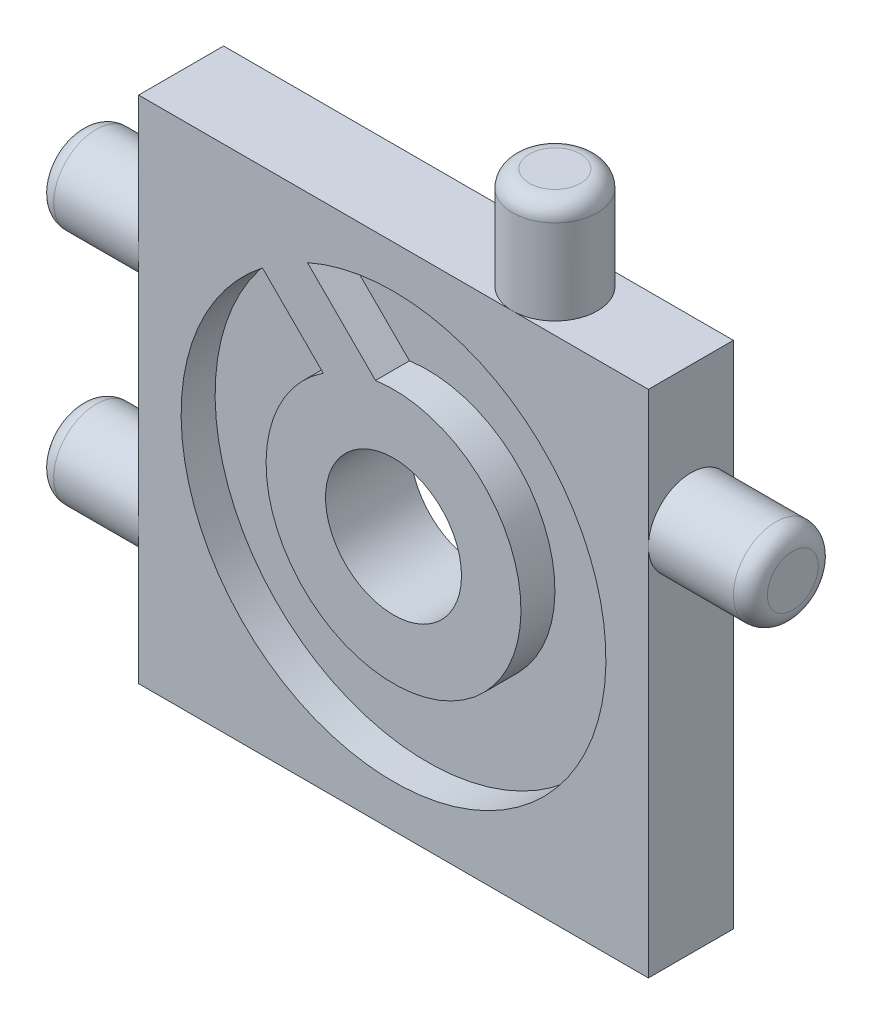
ISO-10303-21;
HEADER;
FILE_DESCRIPTION(('STEP AP214'),'2;1');
FILE_NAME('part.step','',(''),(''),'','','');
FILE_SCHEMA(('AUTOMOTIVE_DESIGN { 1 0 10303 214 1 1 1 1 }'));
ENDSEC;
DATA;
#1=APPLICATION_CONTEXT('core data for automotive mechanical design processes');
#2=APPLICATION_PROTOCOL_DEFINITION('international standard','automotive_design',2000,#1);
#3=PRODUCT_CONTEXT('',#1,'mechanical');
#4=PRODUCT('Part','Part','',(#3));
#5=PRODUCT_RELATED_PRODUCT_CATEGORY('part','',(#4));
#6=PRODUCT_DEFINITION_FORMATION('','',#4);
#7=PRODUCT_DEFINITION_CONTEXT('part definition',#1,'design');
#8=PRODUCT_DEFINITION('design','',#6,#7);
#9=PRODUCT_DEFINITION_SHAPE('','',#8);
#10=(LENGTH_UNIT() NAMED_UNIT(*) SI_UNIT(.MILLI.,.METRE.));
#11=(NAMED_UNIT(*) PLANE_ANGLE_UNIT() SI_UNIT($,.RADIAN.));
#12=(NAMED_UNIT(*) SI_UNIT($,.STERADIAN.) SOLID_ANGLE_UNIT());
#13=UNCERTAINTY_MEASURE_WITH_UNIT(LENGTH_MEASURE(1.E-05),#10,'distance_accuracy_value','');
#14=(GEOMETRIC_REPRESENTATION_CONTEXT(3) GLOBAL_UNCERTAINTY_ASSIGNED_CONTEXT((#13)) GLOBAL_UNIT_ASSIGNED_CONTEXT((#10,
#11,#12)) REPRESENTATION_CONTEXT('',''));
#15=CARTESIAN_POINT('',(0.,0.,0.));
#16=DIRECTION('',(0.,0.,1.));
#17=DIRECTION('',(1.,0.,0.));
#18=AXIS2_PLACEMENT_3D('',#15,#16,#17);
#19=CARTESIAN_POINT('',(0.,0.,0.));
#20=DIRECTION('',(0.,0.,1.));
#21=DIRECTION('',(1.,0.,0.));
#22=AXIS2_PLACEMENT_3D('',#19,#20,#21);
#23=PLANE('',#22);
#24=DIRECTION('',(0.,-1.,0.));
#25=VECTOR('',#24,1.);
#26=CARTESIAN_POINT('',(-15.,15.,0.));
#27=LINE('',#26,#25);
#28=CARTESIAN_POINT('',(-15.,15.,0.));
#29=VERTEX_POINT('',#28);
#30=CARTESIAN_POINT('',(-15.,7.,0.));
#31=VERTEX_POINT('',#30);
#32=EDGE_CURVE('E205',#29,#31,#27,.T.);
#33=ORIENTED_EDGE('',*,*,#32,.F.);
#34=DIRECTION('',(1.,0.,0.));
#35=VECTOR('',#34,1.);
#36=CARTESIAN_POINT('',(-15.,15.,0.));
#37=LINE('',#36,#35);
#38=CARTESIAN_POINT('',(7.,15.,0.));
#39=VERTEX_POINT('',#38);
#40=EDGE_CURVE('E217',#29,#39,#37,.T.);
#41=ORIENTED_EDGE('',*,*,#40,.T.);
#42=CARTESIAN_POINT('',(15.,15.,0.));
#43=VERTEX_POINT('',#42);
#44=EDGE_CURVE('E216',#39,#43,#37,.T.);
#45=ORIENTED_EDGE('',*,*,#44,.T.);
#46=DIRECTION('',(0.,-1.,0.));
#47=VECTOR('',#46,1.);
#48=CARTESIAN_POINT('',(15.,15.,0.));
#49=LINE('',#48,#47);
#50=CARTESIAN_POINT('',(15.,6.99999999999999,0.));
#51=VERTEX_POINT('',#50);
#52=EDGE_CURVE('E213',#43,#51,#49,.T.);
#53=ORIENTED_EDGE('',*,*,#52,.T.);
#54=CARTESIAN_POINT('',(15.,-15.,0.));
#55=VERTEX_POINT('',#54);
#56=EDGE_CURVE('E212',#51,#55,#49,.T.);
#57=ORIENTED_EDGE('',*,*,#56,.T.);
#58=DIRECTION('',(1.,0.,0.));
#59=VECTOR('',#58,1.);
#60=CARTESIAN_POINT('',(-15.,-15.,0.));
#61=LINE('',#60,#59);
#62=CARTESIAN_POINT('',(-15.,-15.,0.));
#63=VERTEX_POINT('',#62);
#64=EDGE_CURVE('E208',#63,#55,#61,.T.);
#65=ORIENTED_EDGE('',*,*,#64,.F.);
#66=CARTESIAN_POINT('',(-15.,-7.,0.));
#67=VERTEX_POINT('',#66);
#68=EDGE_CURVE('E189',#67,#63,#27,.T.);
#69=ORIENTED_EDGE('',*,*,#68,.F.);
#70=EDGE_CURVE('E209',#31,#67,#27,.T.);
#71=ORIENTED_EDGE('',*,*,#70,.F.);
#72=EDGE_LOOP('',(#33,#41,#45,#53,#57,#65,#69,#71));
#73=FACE_BOUND('',#72,.T.);
#74=CARTESIAN_POINT('',(0.,0.,0.));
#75=DIRECTION('',(0.,0.,1.));
#76=DIRECTION('',(1.,0.,0.));
#77=AXIS2_PLACEMENT_3D('',#74,#75,#76);
#78=CIRCLE('',#77,4.);
#79=CARTESIAN_POINT('',(4.,0.,0.));
#80=VERTEX_POINT('',#79);
#81=EDGE_CURVE('E170',#80,#80,#78,.T.);
#82=ORIENTED_EDGE('',*,*,#81,.T.);
#83=EDGE_LOOP('',(#82));
#84=FACE_BOUND('',#83,.T.);
#85=DIRECTION('',(0.707106781186547,0.707106781186548,0.));
#86=VECTOR('',#85,1.);
#87=CARTESIAN_POINT('',(-9.19238815542512,9.19238815542511,0.));
#88=LINE('',#87,#86);
#89=CARTESIAN_POINT('',(-8.13172798364529,10.2530483272049,0.));
#90=VERTEX_POINT('',#89);
#91=CARTESIAN_POINT('',(-6.01040764008565,12.3743686707646,0.));
#92=VERTEX_POINT('',#91);
#93=EDGE_CURVE('E11',#90,#92,#88,.T.);
#94=ORIENTED_EDGE('',*,*,#93,.F.);
#95=DIRECTION('',(0.707106781186548,-0.707106781186547,0.));
#96=VECTOR('',#95,1.);
#97=CARTESIAN_POINT('',(1.06066017177982,1.06066017177982,0.));
#98=LINE('',#97,#96);
#99=CARTESIAN_POINT('',(-3.18198051533946,5.3033008588991,0.));
#100=VERTEX_POINT('',#99);
#101=EDGE_CURVE('E418',#90,#100,#98,.T.);
#102=ORIENTED_EDGE('',*,*,#101,.T.);
#103=DIRECTION('',(0.707106781186547,0.707106781186548,0.));
#104=VECTOR('',#103,1.);
#105=CARTESIAN_POINT('',(-4.24264068711928,4.24264068711928,0.));
#106=LINE('',#105,#104);
#107=CARTESIAN_POINT('',(-1.06066017177982,7.42462120245875,0.));
#108=VERTEX_POINT('',#107);
#109=EDGE_CURVE('E413',#100,#108,#106,.T.);
#110=ORIENTED_EDGE('',*,*,#109,.T.);
#111=DIRECTION('',(0.707106781186547,-0.707106781186548,0.));
#112=VECTOR('',#111,1.);
#113=CARTESIAN_POINT('',(3.18198051533946,3.18198051533946,0.));
#114=LINE('',#113,#112);
#115=EDGE_CURVE('E372',#92,#108,#114,.T.);
#116=ORIENTED_EDGE('',*,*,#115,.F.);
#117=EDGE_LOOP('',(#94,#102,#110,#116));
#118=FACE_BOUND('',#117,.T.);
#119=ADVANCED_FACE('F33',(#73,#84,#118),#23,.F.);
#120=CARTESIAN_POINT('',(0.,0.,3.));
#121=DIRECTION('',(0.,0.,1.));
#122=DIRECTION('',(1.,0.,0.));
#123=AXIS2_PLACEMENT_3D('',#120,#121,#122);
#124=CYLINDRICAL_SURFACE('',#123,12.5);
#125=DIRECTION('',(0.,0.,1.));
#126=VECTOR('',#125,1.);
#127=CARTESIAN_POINT('',(-5.06423073589586,11.4281917665748,3.));
#128=LINE('',#127,#126);
#129=CARTESIAN_POINT('',(-5.06423073589586,11.4281917665748,3.));
#130=VERTEX_POINT('',#129);
#131=CARTESIAN_POINT('',(-5.06423073589586,11.4281917665748,5.));
#132=VERTEX_POINT('',#131);
#133=EDGE_CURVE('E151',#130,#132,#128,.T.);
#134=ORIENTED_EDGE('',*,*,#133,.F.);
#135=CARTESIAN_POINT('',(0.,0.,3.));
#136=DIRECTION('',(0.,0.,1.));
#137=DIRECTION('',(1.,0.,0.));
#138=AXIS2_PLACEMENT_3D('',#135,#136,#137);
#139=CIRCLE('',#138,12.5);
#140=CARTESIAN_POINT('',(-7.7143042156123,9.83562455917194,3.));
#141=VERTEX_POINT('',#140);
#142=EDGE_CURVE('E168',#141,#130,#139,.T.);
#143=ORIENTED_EDGE('',*,*,#142,.F.);
#144=DIRECTION('',(0.,0.,1.));
#145=VECTOR('',#144,1.);
#146=CARTESIAN_POINT('',(-7.7143042156123,9.83562455917194,3.));
#147=LINE('',#146,#145);
#148=CARTESIAN_POINT('',(-7.7143042156123,9.83562455917195,5.));
#149=VERTEX_POINT('',#148);
#150=EDGE_CURVE('E412',#141,#149,#147,.T.);
#151=ORIENTED_EDGE('',*,*,#150,.T.);
#152=CARTESIAN_POINT('',(0.,0.,5.));
#153=DIRECTION('',(0.,0.,1.));
#154=DIRECTION('',(1.,0.,0.));
#155=AXIS2_PLACEMENT_3D('',#152,#153,#154);
#156=CIRCLE('',#155,12.5);
#157=EDGE_CURVE('E166',#149,#132,#156,.T.);
#158=ORIENTED_EDGE('',*,*,#157,.T.);
#159=EDGE_LOOP('',(#134,#143,#151,#158));
#160=FACE_BOUND('',#159,.T.);
#161=ADVANCED_FACE('F272',(#160),#124,.F.);
#162=CARTESIAN_POINT('',(0.,0.,3.));
#163=DIRECTION('',(0.,0.,1.));
#164=DIRECTION('',(1.,0.,0.));
#165=AXIS2_PLACEMENT_3D('',#162,#163,#164);
#166=PLANE('',#165);
#167=ORIENTED_EDGE('',*,*,#142,.T.);
#168=DIRECTION('',(0.707106781186547,-0.707106781186548,0.));
#169=VECTOR('',#168,1.);
#170=CARTESIAN_POINT('',(3.18198051533946,3.18198051533946,3.));
#171=LINE('',#170,#169);
#172=CARTESIAN_POINT('',(-1.06066017177982,7.42462120245875,3.));
#173=VERTEX_POINT('',#172);
#174=EDGE_CURVE('E409',#130,#173,#171,.T.);
#175=ORIENTED_EDGE('',*,*,#174,.T.);
#176=CARTESIAN_POINT('',(0.,0.,3.));
#177=DIRECTION('',(0.,0.,1.));
#178=DIRECTION('',(1.,0.,0.));
#179=AXIS2_PLACEMENT_3D('',#176,#177,#178);
#180=CIRCLE('',#179,7.5);
#181=CARTESIAN_POINT('',(-4.13549225092681,6.25681259448645,3.));
#182=VERTEX_POINT('',#181);
#183=EDGE_CURVE('E161',#182,#173,#180,.T.);
#184=ORIENTED_EDGE('',*,*,#183,.F.);
#185=DIRECTION('',(0.707106781186548,-0.707106781186547,0.));
#186=VECTOR('',#185,1.);
#187=CARTESIAN_POINT('',(1.06066017177982,1.06066017177982,3.));
#188=LINE('',#187,#186);
#189=EDGE_CURVE('E410',#141,#182,#188,.T.);
#190=ORIENTED_EDGE('',*,*,#189,.F.);
#191=EDGE_LOOP('',(#167,#175,#184,#190));
#192=FACE_BOUND('',#191,.T.);
#193=ADVANCED_FACE('F278',(#192),#166,.T.);
#194=CARTESIAN_POINT('',(-15.,15.,5.));
#195=DIRECTION('',(0.,1.,0.));
#196=DIRECTION('',(0.,0.,1.));
#197=AXIS2_PLACEMENT_3D('',#194,#195,#196);
#198=PLANE('',#197);
#199=CARTESIAN_POINT('',(7.,15.,2.5));
#200=DIRECTION('',(0.,1.,0.));
#201=DIRECTION('',(0.,0.,1.));
#202=AXIS2_PLACEMENT_3D('',#199,#200,#201);
#203=CIRCLE('',#202,2.5);
#204=CARTESIAN_POINT('',(7.,15.,5.));
#205=VERTEX_POINT('',#204);
#206=EDGE_CURVE('E369',#205,#39,#203,.T.);
#207=ORIENTED_EDGE('',*,*,#206,.F.);
#208=DIRECTION('',(1.,0.,0.));
#209=VECTOR('',#208,1.);
#210=CARTESIAN_POINT('',(-15.,15.,5.));
#211=LINE('',#210,#209);
#212=CARTESIAN_POINT('',(15.,15.,5.));
#213=VERTEX_POINT('',#212);
#214=EDGE_CURVE('E201',#205,#213,#211,.T.);
#215=ORIENTED_EDGE('',*,*,#214,.T.);
#216=DIRECTION('',(0.,0.,-1.));
#217=VECTOR('',#216,1.);
#218=CARTESIAN_POINT('',(15.,15.,5.));
#219=LINE('',#218,#217);
#220=EDGE_CURVE('E221',#213,#43,#219,.T.);
#221=ORIENTED_EDGE('',*,*,#220,.T.);
#222=ORIENTED_EDGE('',*,*,#44,.F.);
#223=EDGE_LOOP('',(#207,#215,#221,#222));
#224=FACE_BOUND('',#223,.T.);
#225=ADVANCED_FACE('F291',(#224),#198,.T.);
#226=CARTESIAN_POINT('',(15.,15.,5.));
#227=DIRECTION('',(1.,0.,0.));
#228=DIRECTION('',(0.,1.,0.));
#229=AXIS2_PLACEMENT_3D('',#226,#227,#228);
#230=PLANE('',#229);
#231=CARTESIAN_POINT('',(15.,6.99999999999999,2.5));
#232=DIRECTION('',(1.,0.,0.));
#233=DIRECTION('',(0.,1.,0.));
#234=AXIS2_PLACEMENT_3D('',#231,#232,#233);
#235=CIRCLE('',#234,2.5);
#236=CARTESIAN_POINT('',(15.,6.99999999999999,5.));
#237=VERTEX_POINT('',#236);
#238=EDGE_CURVE('E177',#237,#51,#235,.T.);
#239=ORIENTED_EDGE('',*,*,#238,.F.);
#240=DIRECTION('',(0.,-1.,0.));
#241=VECTOR('',#240,1.);
#242=CARTESIAN_POINT('',(15.,15.,5.));
#243=LINE('',#242,#241);
#244=CARTESIAN_POINT('',(15.,-15.,5.));
#245=VERTEX_POINT('',#244);
#246=EDGE_CURVE('E198',#237,#245,#243,.T.);
#247=ORIENTED_EDGE('',*,*,#246,.T.);
#248=DIRECTION('',(0.,0.,-1.));
#249=VECTOR('',#248,1.);
#250=CARTESIAN_POINT('',(15.,-15.,5.));
#251=LINE('',#250,#249);
#252=EDGE_CURVE('E224',#245,#55,#251,.T.);
#253=ORIENTED_EDGE('',*,*,#252,.T.);
#254=ORIENTED_EDGE('',*,*,#56,.F.);
#255=EDGE_LOOP('',(#239,#247,#253,#254));
#256=FACE_BOUND('',#255,.T.);
#257=ADVANCED_FACE('F296',(#256),#230,.T.);
#258=CARTESIAN_POINT('',(-15.,15.,5.));
#259=DIRECTION('',(1.,0.,0.));
#260=DIRECTION('',(0.,1.,0.));
#261=AXIS2_PLACEMENT_3D('',#258,#259,#260);
#262=PLANE('',#261);
#263=CARTESIAN_POINT('',(-15.,-7.,2.5));
#264=DIRECTION('',(-1.,0.,0.));
#265=DIRECTION('',(0.,-1.,0.));
#266=AXIS2_PLACEMENT_3D('',#263,#264,#265);
#267=CIRCLE('',#266,2.5);
#268=CARTESIAN_POINT('',(-15.,-7.,5.));
#269=VERTEX_POINT('',#268);
#270=EDGE_CURVE('E181',#67,#269,#267,.T.);
#271=ORIENTED_EDGE('',*,*,#270,.F.);
#272=ORIENTED_EDGE('',*,*,#68,.T.);
#273=DIRECTION('',(0.,0.,-1.));
#274=VECTOR('',#273,1.);
#275=CARTESIAN_POINT('',(-15.,-15.,5.));
#276=LINE('',#275,#274);
#277=CARTESIAN_POINT('',(-15.,-15.,5.));
#278=VERTEX_POINT('',#277);
#279=EDGE_CURVE('E227',#278,#63,#276,.T.);
#280=ORIENTED_EDGE('',*,*,#279,.F.);
#281=DIRECTION('',(0.,-1.,0.));
#282=VECTOR('',#281,1.);
#283=CARTESIAN_POINT('',(-15.,15.,5.));
#284=LINE('',#283,#282);
#285=EDGE_CURVE('E195',#269,#278,#284,.T.);
#286=ORIENTED_EDGE('',*,*,#285,.F.);
#287=EDGE_LOOP('',(#271,#272,#280,#286));
#288=FACE_BOUND('',#287,.T.);
#289=ADVANCED_FACE('F305',(#288),#262,.F.);
#290=CARTESIAN_POINT('',(-15.,7.,2.5));
#291=DIRECTION('',(-1.,0.,0.));
#292=DIRECTION('',(0.,-1.,0.));
#293=AXIS2_PLACEMENT_3D('',#290,#291,#292);
#294=CIRCLE('',#293,2.5);
#295=CARTESIAN_POINT('',(-15.,7.,5.));
#296=VERTEX_POINT('',#295);
#297=EDGE_CURVE('E186',#296,#31,#294,.T.);
#298=ORIENTED_EDGE('',*,*,#297,.F.);
#299=CARTESIAN_POINT('',(-15.,15.,5.));
#300=VERTEX_POINT('',#299);
#301=EDGE_CURVE('E191',#300,#296,#284,.T.);
#302=ORIENTED_EDGE('',*,*,#301,.F.);
#303=DIRECTION('',(0.,0.,-1.));
#304=VECTOR('',#303,1.);
#305=CARTESIAN_POINT('',(-15.,15.,5.));
#306=LINE('',#305,#304);
#307=EDGE_CURVE('E204',#300,#29,#306,.T.);
#308=ORIENTED_EDGE('',*,*,#307,.T.);
#309=ORIENTED_EDGE('',*,*,#32,.T.);
#310=EDGE_LOOP('',(#298,#302,#308,#309));
#311=FACE_BOUND('',#310,.T.);
#312=ADVANCED_FACE('F303',(#311),#262,.F.);
#313=EDGE_CURVE('E183',#269,#67,#267,.T.);
#314=ORIENTED_EDGE('',*,*,#313,.F.);
#315=EDGE_CURVE('E194',#296,#269,#284,.T.);
#316=ORIENTED_EDGE('',*,*,#315,.F.);
#317=EDGE_CURVE('E190',#31,#296,#294,.T.);
#318=ORIENTED_EDGE('',*,*,#317,.F.);
#319=ORIENTED_EDGE('',*,*,#70,.T.);
#320=EDGE_LOOP('',(#314,#316,#318,#319));
#321=FACE_BOUND('',#320,.T.);
#322=ADVANCED_FACE('F299',(#321),#262,.F.);
#323=CARTESIAN_POINT('',(-15.,-15.,5.));
#324=DIRECTION('',(0.,1.,0.));
#325=DIRECTION('',(0.,0.,1.));
#326=AXIS2_PLACEMENT_3D('',#323,#324,#325);
#327=PLANE('',#326);
#328=ORIENTED_EDGE('',*,*,#64,.T.);
#329=ORIENTED_EDGE('',*,*,#252,.F.);
#330=DIRECTION('',(1.,0.,0.));
#331=VECTOR('',#330,1.);
#332=CARTESIAN_POINT('',(-15.,-15.,5.));
#333=LINE('',#332,#331);
#334=EDGE_CURVE('E193',#278,#245,#333,.T.);
#335=ORIENTED_EDGE('',*,*,#334,.F.);
#336=ORIENTED_EDGE('',*,*,#279,.T.);
#337=EDGE_LOOP('',(#328,#329,#335,#336));
#338=FACE_BOUND('',#337,.T.);
#339=ADVANCED_FACE('F294',(#338),#327,.F.);
#340=EDGE_CURVE('E182',#51,#237,#235,.T.);
#341=ORIENTED_EDGE('',*,*,#340,.F.);
#342=ORIENTED_EDGE('',*,*,#52,.F.);
#343=ORIENTED_EDGE('',*,*,#220,.F.);
#344=EDGE_CURVE('E199',#213,#237,#243,.T.);
#345=ORIENTED_EDGE('',*,*,#344,.T.);
#346=EDGE_LOOP('',(#341,#342,#343,#345));
#347=FACE_BOUND('',#346,.T.);
#348=ADVANCED_FACE('F289',(#347),#230,.T.);
#349=EDGE_CURVE('E248',#39,#205,#203,.T.);
#350=ORIENTED_EDGE('',*,*,#349,.F.);
#351=ORIENTED_EDGE('',*,*,#40,.F.);
#352=ORIENTED_EDGE('',*,*,#307,.F.);
#353=EDGE_CURVE('E202',#300,#205,#211,.T.);
#354=ORIENTED_EDGE('',*,*,#353,.T.);
#355=EDGE_LOOP('',(#350,#351,#352,#354));
#356=FACE_BOUND('',#355,.T.);
#357=ADVANCED_FACE('F286',(#356),#198,.T.);
#358=CARTESIAN_POINT('',(0.,0.,5.));
#359=DIRECTION('',(0.,0.,1.));
#360=DIRECTION('',(1.,0.,0.));
#361=AXIS2_PLACEMENT_3D('',#358,#359,#360);
#362=PLANE('',#361);
#363=DIRECTION('',(0.707106781186547,-0.707106781186548,0.));
#364=VECTOR('',#363,1.);
#365=CARTESIAN_POINT('',(-6.01040764008565,12.3743686707646,5.));
#366=LINE('',#365,#364);
#367=CARTESIAN_POINT('',(-1.06066017177982,7.42462120245875,5.));
#368=VERTEX_POINT('',#367);
#369=EDGE_CURVE('E145',#132,#368,#366,.T.);
#370=ORIENTED_EDGE('',*,*,#369,.F.);
#371=ORIENTED_EDGE('',*,*,#157,.F.);
#372=DIRECTION('',(0.707106781186548,-0.707106781186547,0.));
#373=VECTOR('',#372,1.);
#374=CARTESIAN_POINT('',(-8.13172798364529,10.2530483272049,5.));
#375=LINE('',#374,#373);
#376=CARTESIAN_POINT('',(-4.13549225092681,6.25681259448645,5.));
#377=VERTEX_POINT('',#376);
#378=EDGE_CURVE('E56',#149,#377,#375,.T.);
#379=ORIENTED_EDGE('',*,*,#378,.T.);
#380=CARTESIAN_POINT('',(0.,0.,5.));
#381=DIRECTION('',(0.,0.,1.));
#382=DIRECTION('',(1.,0.,0.));
#383=AXIS2_PLACEMENT_3D('',#380,#381,#382);
#384=CIRCLE('',#383,7.5);
#385=EDGE_CURVE('E159',#377,#368,#384,.T.);
#386=ORIENTED_EDGE('',*,*,#385,.T.);
#387=EDGE_LOOP('',(#370,#371,#379,#386));
#388=FACE_BOUND('',#387,.T.);
#389=CARTESIAN_POINT('',(0.,0.,5.));
#390=DIRECTION('',(0.,0.,1.));
#391=DIRECTION('',(1.,0.,0.));
#392=AXIS2_PLACEMENT_3D('',#389,#390,#391);
#393=CIRCLE('',#392,4.);
#394=CARTESIAN_POINT('',(4.,0.,5.));
#395=VERTEX_POINT('',#394);
#396=EDGE_CURVE('E173',#395,#395,#393,.T.);
#397=ORIENTED_EDGE('',*,*,#396,.F.);
#398=EDGE_LOOP('',(#397));
#399=FACE_BOUND('',#398,.T.);
#400=ORIENTED_EDGE('',*,*,#301,.T.);
#401=ORIENTED_EDGE('',*,*,#315,.T.);
#402=ORIENTED_EDGE('',*,*,#285,.T.);
#403=ORIENTED_EDGE('',*,*,#334,.T.);
#404=ORIENTED_EDGE('',*,*,#246,.F.);
#405=ORIENTED_EDGE('',*,*,#344,.F.);
#406=ORIENTED_EDGE('',*,*,#214,.F.);
#407=ORIENTED_EDGE('',*,*,#353,.F.);
#408=EDGE_LOOP('',(#400,#401,#402,#403,#404,#405,#406,#407));
#409=FACE_BOUND('',#408,.T.);
#410=ADVANCED_FACE('F164',(#388,#399,#409),#362,.T.);
#411=CARTESIAN_POINT('',(-21.,6.99999999999999,2.5));
#412=DIRECTION('',(1.,0.,0.));
#413=DIRECTION('',(0.,1.,0.));
#414=AXIS2_PLACEMENT_3D('',#411,#412,#413);
#415=CYLINDRICAL_SURFACE('',#414,2.5);
#416=CARTESIAN_POINT('',(-20.,6.99999999999999,2.5));
#417=DIRECTION('',(-1.,0.,0.));
#418=DIRECTION('',(0.,-1.,0.));
#419=AXIS2_PLACEMENT_3D('',#416,#417,#418);
#420=CIRCLE('',#419,2.5);
#421=CARTESIAN_POINT('',(-20.,4.5,2.5));
#422=VERTEX_POINT('',#421);
#423=EDGE_CURVE('E239',#422,#422,#420,.F.);
#424=ORIENTED_EDGE('',*,*,#423,.T.);
#425=EDGE_LOOP('',(#424));
#426=FACE_BOUND('',#425,.T.);
#427=ORIENTED_EDGE('',*,*,#297,.T.);
#428=ORIENTED_EDGE('',*,*,#317,.T.);
#429=EDGE_LOOP('',(#427,#428));
#430=FACE_BOUND('',#429,.T.);
#431=ADVANCED_FACE('F361',(#426,#430),#415,.T.);
#432=CARTESIAN_POINT('',(-21.,6.99999999999999,2.5));
#433=DIRECTION('',(-1.,0.,0.));
#434=DIRECTION('',(0.,-1.,0.));
#435=AXIS2_PLACEMENT_3D('',#432,#433,#434);
#436=PLANE('',#435);
#437=CARTESIAN_POINT('',(-21.,6.99999999999999,2.5));
#438=DIRECTION('',(-1.,0.,0.));
#439=DIRECTION('',(0.,-1.,0.));
#440=AXIS2_PLACEMENT_3D('',#437,#438,#439);
#441=CIRCLE('',#440,1.5);
#442=CARTESIAN_POINT('',(-21.,5.49999999999999,2.5));
#443=VERTEX_POINT('',#442);
#444=EDGE_CURVE('E236',#443,#443,#441,.T.);
#445=ORIENTED_EDGE('',*,*,#444,.T.);
#446=EDGE_LOOP('',(#445));
#447=FACE_BOUND('',#446,.T.);
#448=ADVANCED_FACE('F388',(#447),#436,.T.);
#449=CARTESIAN_POINT('',(-21.,-7.,2.5));
#450=DIRECTION('',(1.,0.,0.));
#451=DIRECTION('',(0.,1.,0.));
#452=AXIS2_PLACEMENT_3D('',#449,#450,#451);
#453=CYLINDRICAL_SURFACE('',#452,2.5);
#454=CARTESIAN_POINT('',(-20.,-7.,2.5));
#455=DIRECTION('',(-1.,0.,0.));
#456=DIRECTION('',(0.,-1.,0.));
#457=AXIS2_PLACEMENT_3D('',#454,#455,#456);
#458=CIRCLE('',#457,2.5);
#459=CARTESIAN_POINT('',(-20.,-9.5,2.5));
#460=VERTEX_POINT('',#459);
#461=EDGE_CURVE('E233',#460,#460,#458,.F.);
#462=ORIENTED_EDGE('',*,*,#461,.T.);
#463=EDGE_LOOP('',(#462));
#464=FACE_BOUND('',#463,.T.);
#465=ORIENTED_EDGE('',*,*,#313,.T.);
#466=ORIENTED_EDGE('',*,*,#270,.T.);
#467=EDGE_LOOP('',(#465,#466));
#468=FACE_BOUND('',#467,.T.);
#469=ADVANCED_FACE('F356',(#464,#468),#453,.T.);
#470=CARTESIAN_POINT('',(-21.,-7.,2.5));
#471=DIRECTION('',(-1.,0.,0.));
#472=DIRECTION('',(0.,-1.,0.));
#473=AXIS2_PLACEMENT_3D('',#470,#471,#472);
#474=PLANE('',#473);
#475=CARTESIAN_POINT('',(-21.,-7.,2.5));
#476=DIRECTION('',(-1.,0.,0.));
#477=DIRECTION('',(0.,-1.,0.));
#478=AXIS2_PLACEMENT_3D('',#475,#476,#477);
#479=CIRCLE('',#478,1.5);
#480=CARTESIAN_POINT('',(-21.,-8.5,2.5));
#481=VERTEX_POINT('',#480);
#482=EDGE_CURVE('E230',#481,#481,#479,.T.);
#483=ORIENTED_EDGE('',*,*,#482,.T.);
#484=EDGE_LOOP('',(#483));
#485=FACE_BOUND('',#484,.T.);
#486=ADVANCED_FACE('F310',(#485),#474,.T.);
#487=CARTESIAN_POINT('',(-20.,-7.,2.5));
#488=DIRECTION('',(-1.,0.,0.));
#489=DIRECTION('',(0.,-1.,0.));
#490=AXIS2_PLACEMENT_3D('',#487,#488,#489);
#491=TOROIDAL_SURFACE('',#490,1.5,1.);
#492=ORIENTED_EDGE('',*,*,#461,.F.);
#493=EDGE_LOOP('',(#492));
#494=FACE_BOUND('',#493,.T.);
#495=ORIENTED_EDGE('',*,*,#482,.F.);
#496=EDGE_LOOP('',(#495));
#497=FACE_BOUND('',#496,.T.);
#498=ADVANCED_FACE('F306',(#494,#497),#491,.T.);
#499=CARTESIAN_POINT('',(-20.,6.99999999999999,2.5));
#500=DIRECTION('',(-1.,0.,0.));
#501=DIRECTION('',(0.,-1.,0.));
#502=AXIS2_PLACEMENT_3D('',#499,#500,#501);
#503=TOROIDAL_SURFACE('',#502,1.5,1.);
#504=ORIENTED_EDGE('',*,*,#423,.F.);
#505=EDGE_LOOP('',(#504));
#506=FACE_BOUND('',#505,.T.);
#507=ORIENTED_EDGE('',*,*,#444,.F.);
#508=EDGE_LOOP('',(#507));
#509=FACE_BOUND('',#508,.T.);
#510=ADVANCED_FACE('F309',(#506,#509),#503,.T.);
#511=CARTESIAN_POINT('',(21.,6.99999999999999,2.5));
#512=DIRECTION('',(-1.,0.,0.));
#513=DIRECTION('',(0.,-1.,0.));
#514=AXIS2_PLACEMENT_3D('',#511,#512,#513);
#515=CYLINDRICAL_SURFACE('',#514,2.5);
#516=CARTESIAN_POINT('',(20.,6.99999999999999,2.5));
#517=DIRECTION('',(1.,0.,0.));
#518=DIRECTION('',(0.,1.,0.));
#519=AXIS2_PLACEMENT_3D('',#516,#517,#518);
#520=CIRCLE('',#519,2.5);
#521=CARTESIAN_POINT('',(20.,9.5,2.5));
#522=VERTEX_POINT('',#521);
#523=EDGE_CURVE('E245',#522,#522,#520,.F.);
#524=ORIENTED_EDGE('',*,*,#523,.T.);
#525=EDGE_LOOP('',(#524));
#526=FACE_BOUND('',#525,.T.);
#527=ORIENTED_EDGE('',*,*,#238,.T.);
#528=ORIENTED_EDGE('',*,*,#340,.T.);
#529=EDGE_LOOP('',(#527,#528));
#530=FACE_BOUND('',#529,.T.);
#531=ADVANCED_FACE('F313',(#526,#530),#515,.T.);
#532=CARTESIAN_POINT('',(21.,6.99999999999999,2.5));
#533=DIRECTION('',(1.,0.,0.));
#534=DIRECTION('',(0.,1.,0.));
#535=AXIS2_PLACEMENT_3D('',#532,#533,#534);
#536=PLANE('',#535);
#537=CARTESIAN_POINT('',(21.,6.99999999999999,2.5));
#538=DIRECTION('',(1.,0.,0.));
#539=DIRECTION('',(0.,1.,0.));
#540=AXIS2_PLACEMENT_3D('',#537,#538,#539);
#541=CIRCLE('',#540,1.5);
#542=CARTESIAN_POINT('',(21.,8.5,2.5));
#543=VERTEX_POINT('',#542);
#544=EDGE_CURVE('E242',#543,#543,#541,.T.);
#545=ORIENTED_EDGE('',*,*,#544,.T.);
#546=EDGE_LOOP('',(#545));
#547=FACE_BOUND('',#546,.T.);
#548=ADVANCED_FACE('F317',(#547),#536,.T.);
#549=CARTESIAN_POINT('',(20.,6.99999999999999,2.5));
#550=DIRECTION('',(1.,0.,0.));
#551=DIRECTION('',(0.,1.,0.));
#552=AXIS2_PLACEMENT_3D('',#549,#550,#551);
#553=TOROIDAL_SURFACE('',#552,1.5,1.);
#554=ORIENTED_EDGE('',*,*,#523,.F.);
#555=EDGE_LOOP('',(#554));
#556=FACE_BOUND('',#555,.T.);
#557=ORIENTED_EDGE('',*,*,#544,.F.);
#558=EDGE_LOOP('',(#557));
#559=FACE_BOUND('',#558,.T.);
#560=ADVANCED_FACE('F315',(#556,#559),#553,.T.);
#561=CARTESIAN_POINT('',(0.,0.,5.));
#562=DIRECTION('',(0.,0.,-1.));
#563=DIRECTION('',(-1.,0.,0.));
#564=AXIS2_PLACEMENT_3D('',#561,#562,#563);
#565=CYLINDRICAL_SURFACE('',#564,7.5);
#566=ORIENTED_EDGE('',*,*,#183,.T.);
#567=DIRECTION('',(0.,0.,1.));
#568=VECTOR('',#567,1.);
#569=CARTESIAN_POINT('',(-1.06066017177982,7.42462120245875,-2.5));
#570=LINE('',#569,#568);
#571=EDGE_CURVE('E148',#173,#368,#570,.T.);
#572=ORIENTED_EDGE('',*,*,#571,.T.);
#573=ORIENTED_EDGE('',*,*,#385,.F.);
#574=DIRECTION('',(0.,0.,-1.));
#575=VECTOR('',#574,1.);
#576=CARTESIAN_POINT('',(-4.13549225092681,6.25681259448645,5.));
#577=LINE('',#576,#575);
#578=EDGE_CURVE('E423',#377,#182,#577,.T.);
#579=ORIENTED_EDGE('',*,*,#578,.T.);
#580=EDGE_LOOP('',(#566,#572,#573,#579));
#581=FACE_BOUND('',#580,.T.);
#582=ADVANCED_FACE('F157',(#581),#565,.T.);
#583=CARTESIAN_POINT('',(0.,0.,0.));
#584=DIRECTION('',(0.,0.,1.));
#585=DIRECTION('',(1.,0.,0.));
#586=AXIS2_PLACEMENT_3D('',#583,#584,#585);
#587=CYLINDRICAL_SURFACE('',#586,4.);
#588=ORIENTED_EDGE('',*,*,#81,.F.);
#589=EDGE_LOOP('',(#588));
#590=FACE_BOUND('',#589,.T.);
#591=ORIENTED_EDGE('',*,*,#396,.T.);
#592=EDGE_LOOP('',(#591));
#593=FACE_BOUND('',#592,.T.);
#594=ADVANCED_FACE('F268',(#590,#593),#587,.F.);
#595=CARTESIAN_POINT('',(7.,21.,2.5));
#596=DIRECTION('',(0.,-1.,0.));
#597=DIRECTION('',(0.,0.,-1.));
#598=AXIS2_PLACEMENT_3D('',#595,#596,#597);
#599=CYLINDRICAL_SURFACE('',#598,2.5);
#600=CARTESIAN_POINT('',(7.,20.,2.5));
#601=DIRECTION('',(0.,1.,0.));
#602=DIRECTION('',(0.,0.,1.));
#603=AXIS2_PLACEMENT_3D('',#600,#601,#602);
#604=CIRCLE('',#603,2.5);
#605=CARTESIAN_POINT('',(7.,20.,5.));
#606=VERTEX_POINT('',#605);
#607=EDGE_CURVE('E41',#606,#606,#604,.F.);
#608=ORIENTED_EDGE('',*,*,#607,.T.);
#609=EDGE_LOOP('',(#608));
#610=FACE_BOUND('',#609,.T.);
#611=ORIENTED_EDGE('',*,*,#206,.T.);
#612=ORIENTED_EDGE('',*,*,#349,.T.);
#613=EDGE_LOOP('',(#611,#612));
#614=FACE_BOUND('',#613,.T.);
#615=ADVANCED_FACE('F254',(#610,#614),#599,.T.);
#616=CARTESIAN_POINT('',(7.,21.,2.5));
#617=DIRECTION('',(0.,1.,0.));
#618=DIRECTION('',(0.,0.,1.));
#619=AXIS2_PLACEMENT_3D('',#616,#617,#618);
#620=PLANE('',#619);
#621=CARTESIAN_POINT('',(7.,21.,2.5));
#622=DIRECTION('',(0.,1.,0.));
#623=DIRECTION('',(0.,0.,1.));
#624=AXIS2_PLACEMENT_3D('',#621,#622,#623);
#625=CIRCLE('',#624,1.5);
#626=CARTESIAN_POINT('',(7.,21.,4.));
#627=VERTEX_POINT('',#626);
#628=EDGE_CURVE('E249',#627,#627,#625,.T.);
#629=ORIENTED_EDGE('',*,*,#628,.T.);
#630=EDGE_LOOP('',(#629));
#631=FACE_BOUND('',#630,.T.);
#632=ADVANCED_FACE('F260',(#631),#620,.T.);
#633=CARTESIAN_POINT('',(7.,20.,2.5));
#634=DIRECTION('',(0.,1.,0.));
#635=DIRECTION('',(0.,0.,1.));
#636=AXIS2_PLACEMENT_3D('',#633,#634,#635);
#637=TOROIDAL_SURFACE('',#636,1.5,1.);
#638=ORIENTED_EDGE('',*,*,#607,.F.);
#639=EDGE_LOOP('',(#638));
#640=FACE_BOUND('',#639,.T.);
#641=ORIENTED_EDGE('',*,*,#628,.F.);
#642=EDGE_LOOP('',(#641));
#643=FACE_BOUND('',#642,.T.);
#644=ADVANCED_FACE('F35',(#640,#643),#637,.T.);
#645=CARTESIAN_POINT('',(-8.13172798364529,10.2530483272049,-2.5));
#646=DIRECTION('',(-0.707106781186547,-0.707106781186548,0.));
#647=DIRECTION('',(0.707106781186548,-0.707106781186547,0.));
#648=AXIS2_PLACEMENT_3D('',#645,#646,#647);
#649=PLANE('',#648);
#650=ORIENTED_EDGE('',*,*,#150,.F.);
#651=ORIENTED_EDGE('',*,*,#189,.T.);
#652=ORIENTED_EDGE('',*,*,#578,.F.);
#653=ORIENTED_EDGE('',*,*,#378,.F.);
#654=EDGE_LOOP('',(#650,#651,#652,#653));
#655=FACE_BOUND('',#654,.T.);
#656=ADVANCED_FACE('F259',(#655),#649,.T.);
#657=CARTESIAN_POINT('',(-6.01040764008565,12.3743686707646,-2.5));
#658=DIRECTION('',(-0.707106781186548,-0.707106781186547,0.));
#659=DIRECTION('',(0.707106781186547,-0.707106781186548,0.));
#660=AXIS2_PLACEMENT_3D('',#657,#658,#659);
#661=PLANE('',#660);
#662=ORIENTED_EDGE('',*,*,#174,.F.);
#663=ORIENTED_EDGE('',*,*,#133,.T.);
#664=ORIENTED_EDGE('',*,*,#369,.T.);
#665=ORIENTED_EDGE('',*,*,#571,.F.);
#666=EDGE_LOOP('',(#662,#663,#664,#665));
#667=FACE_BOUND('',#666,.T.);
#668=ADVANCED_FACE('F147',(#667),#661,.F.);
#669=CARTESIAN_POINT('',(-8.13172798364529,10.2530483272049,-2.5));
#670=DIRECTION('',(0.707106781186548,-0.707106781186547,0.));
#671=DIRECTION('',(0.707106781186547,0.707106781186548,0.));
#672=AXIS2_PLACEMENT_3D('',#669,#670,#671);
#673=PLANE('',#672);
#674=DIRECTION('',(0.,0.,1.));
#675=VECTOR('',#674,1.);
#676=CARTESIAN_POINT('',(-8.13172798364529,10.2530483272049,-2.5));
#677=LINE('',#676,#675);
#678=CARTESIAN_POINT('',(-8.13172798364529,10.2530483272049,-2.5));
#679=VERTEX_POINT('',#678);
#680=EDGE_CURVE('E430',#679,#90,#677,.T.);
#681=ORIENTED_EDGE('',*,*,#680,.T.);
#682=ORIENTED_EDGE('',*,*,#93,.T.);
#683=DIRECTION('',(0.,0.,1.));
#684=VECTOR('',#683,1.);
#685=CARTESIAN_POINT('',(-6.01040764008565,12.3743686707646,-2.5));
#686=LINE('',#685,#684);
#687=CARTESIAN_POINT('',(-6.01040764008565,12.3743686707646,-2.5));
#688=VERTEX_POINT('',#687);
#689=EDGE_CURVE('E425',#688,#92,#686,.T.);
#690=ORIENTED_EDGE('',*,*,#689,.F.);
#691=DIRECTION('',(0.707106781186547,0.707106781186548,0.));
#692=VECTOR('',#691,1.);
#693=CARTESIAN_POINT('',(-8.13172798364529,10.2530483272049,-2.5));
#694=LINE('',#693,#692);
#695=EDGE_CURVE('E440',#679,#688,#694,.T.);
#696=ORIENTED_EDGE('',*,*,#695,.F.);
#697=EDGE_LOOP('',(#681,#682,#690,#696));
#698=FACE_BOUND('',#697,.T.);
#699=ADVANCED_FACE('F451',(#698),#673,.F.);
#700=ORIENTED_EDGE('',*,*,#689,.T.);
#701=ORIENTED_EDGE('',*,*,#115,.T.);
#702=CARTESIAN_POINT('',(-1.06066017177982,7.42462120245875,-2.5));
#703=VERTEX_POINT('',#702);
#704=EDGE_CURVE('E162',#703,#108,#570,.T.);
#705=ORIENTED_EDGE('',*,*,#704,.F.);
#706=DIRECTION('',(0.707106781186547,-0.707106781186548,0.));
#707=VECTOR('',#706,1.);
#708=CARTESIAN_POINT('',(-6.01040764008565,12.3743686707646,-2.5));
#709=LINE('',#708,#707);
#710=EDGE_CURVE('E438',#688,#703,#709,.T.);
#711=ORIENTED_EDGE('',*,*,#710,.F.);
#712=EDGE_LOOP('',(#700,#701,#705,#711));
#713=FACE_BOUND('',#712,.T.);
#714=ADVANCED_FACE('F455',(#713),#661,.F.);
#715=CARTESIAN_POINT('',(-3.18198051533946,5.3033008588991,-2.5));
#716=DIRECTION('',(0.707106781186548,-0.707106781186547,0.));
#717=DIRECTION('',(0.707106781186547,0.707106781186548,0.));
#718=AXIS2_PLACEMENT_3D('',#715,#716,#717);
#719=PLANE('',#718);
#720=ORIENTED_EDGE('',*,*,#109,.F.);
#721=DIRECTION('',(0.,0.,1.));
#722=VECTOR('',#721,1.);
#723=CARTESIAN_POINT('',(-3.18198051533946,5.3033008588991,-2.5));
#724=LINE('',#723,#722);
#725=CARTESIAN_POINT('',(-3.18198051533946,5.3033008588991,-2.5));
#726=VERTEX_POINT('',#725);
#727=EDGE_CURVE('E48',#726,#100,#724,.T.);
#728=ORIENTED_EDGE('',*,*,#727,.F.);
#729=DIRECTION('',(0.707106781186547,0.707106781186548,0.));
#730=VECTOR('',#729,1.);
#731=CARTESIAN_POINT('',(-3.18198051533946,5.3033008588991,-2.5));
#732=LINE('',#731,#730);
#733=EDGE_CURVE('E435',#726,#703,#732,.T.);
#734=ORIENTED_EDGE('',*,*,#733,.T.);
#735=ORIENTED_EDGE('',*,*,#704,.T.);
#736=EDGE_LOOP('',(#720,#728,#734,#735));
#737=FACE_BOUND('',#736,.T.);
#738=ADVANCED_FACE('F457',(#737),#719,.T.);
#739=ORIENTED_EDGE('',*,*,#101,.F.);
#740=ORIENTED_EDGE('',*,*,#680,.F.);
#741=DIRECTION('',(0.707106781186548,-0.707106781186547,0.));
#742=VECTOR('',#741,1.);
#743=CARTESIAN_POINT('',(-8.13172798364529,10.2530483272049,-2.5));
#744=LINE('',#743,#742);
#745=EDGE_CURVE('E433',#679,#726,#744,.T.);
#746=ORIENTED_EDGE('',*,*,#745,.T.);
#747=ORIENTED_EDGE('',*,*,#727,.T.);
#748=EDGE_LOOP('',(#739,#740,#746,#747));
#749=FACE_BOUND('',#748,.T.);
#750=ADVANCED_FACE('F458',(#749),#649,.T.);
#751=CARTESIAN_POINT('',(0.,0.,-2.5));
#752=DIRECTION('',(0.,0.,-1.));
#753=DIRECTION('',(-1.,0.,0.));
#754=AXIS2_PLACEMENT_3D('',#751,#752,#753);
#755=PLANE('',#754);
#756=ORIENTED_EDGE('',*,*,#695,.T.);
#757=ORIENTED_EDGE('',*,*,#710,.T.);
#758=ORIENTED_EDGE('',*,*,#733,.F.);
#759=ORIENTED_EDGE('',*,*,#745,.F.);
#760=EDGE_LOOP('',(#756,#757,#758,#759));
#761=FACE_BOUND('',#760,.T.);
#762=ADVANCED_FACE('F447',(#761),#755,.T.);
#763=CLOSED_SHELL('',(#119,#161,#193,#225,#257,#289,#312,#322,#339,#348,#357,#410,#431,#448,
#469,#486,#498,#510,#531,#548,#560,#582,#594,#615,#632,#644,#656,#668,#699,#714,#738,#750,#762));
#764=MANIFOLD_SOLID_BREP('B2',#763);
#765=ADVANCED_BREP_SHAPE_REPRESENTATION('',(#18,#764),#14);
#766=SHAPE_DEFINITION_REPRESENTATION(#9,#765);
ENDSEC;
END-ISO-10303-21;
